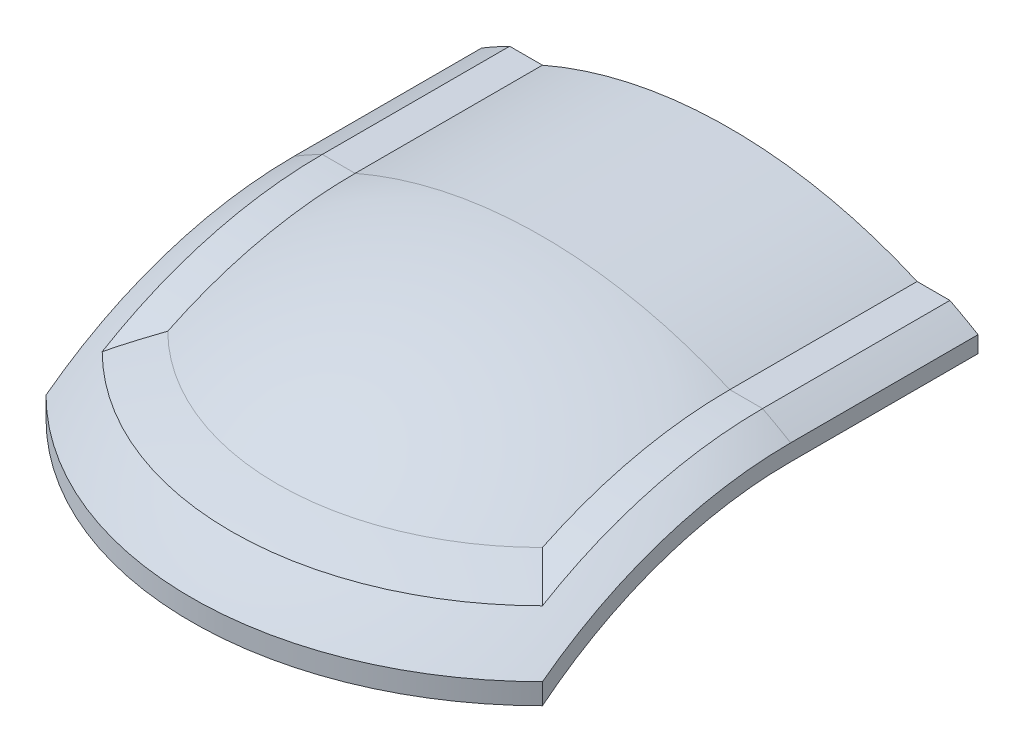
ISO-10303-21;
HEADER;
FILE_DESCRIPTION(('STEP AP214'),'2;1');
FILE_NAME('part.step','',(''),(''),'','','');
FILE_SCHEMA(('AUTOMOTIVE_DESIGN { 1 0 10303 214 1 1 1 1 }'));
ENDSEC;
DATA;
#1=APPLICATION_CONTEXT('core data for automotive mechanical design processes');
#2=APPLICATION_PROTOCOL_DEFINITION('international standard','automotive_design',2000,#1);
#3=PRODUCT_CONTEXT('',#1,'mechanical');
#4=PRODUCT('Part','Part','',(#3));
#5=PRODUCT_RELATED_PRODUCT_CATEGORY('part','',(#4));
#6=PRODUCT_DEFINITION_FORMATION('','',#4);
#7=PRODUCT_DEFINITION_CONTEXT('part definition',#1,'design');
#8=PRODUCT_DEFINITION('design','',#6,#7);
#9=PRODUCT_DEFINITION_SHAPE('','',#8);
#10=(LENGTH_UNIT() NAMED_UNIT(*) SI_UNIT(.MILLI.,.METRE.));
#11=(NAMED_UNIT(*) PLANE_ANGLE_UNIT() SI_UNIT($,.RADIAN.));
#12=(NAMED_UNIT(*) SI_UNIT($,.STERADIAN.) SOLID_ANGLE_UNIT());
#13=UNCERTAINTY_MEASURE_WITH_UNIT(LENGTH_MEASURE(1.E-05),#10,'distance_accuracy_value','');
#14=(GEOMETRIC_REPRESENTATION_CONTEXT(3) GLOBAL_UNCERTAINTY_ASSIGNED_CONTEXT((#13)) GLOBAL_UNIT_ASSIGNED_CONTEXT((#10,
#11,#12)) REPRESENTATION_CONTEXT('',''));
#15=CARTESIAN_POINT('',(0.,0.,0.));
#16=DIRECTION('',(0.,0.,1.));
#17=DIRECTION('',(1.,0.,0.));
#18=AXIS2_PLACEMENT_3D('',#15,#16,#17);
#19=CARTESIAN_POINT('',(-50.,0.,-40.));
#20=DIRECTION('',(1.,0.,0.));
#21=DIRECTION('',(0.,0.,-1.));
#22=AXIS2_PLACEMENT_3D('',#19,#20,#21);
#23=PLANE('',#22);
#24=DIRECTION('',(0.,-1.,0.));
#25=VECTOR('',#24,1.);
#26=CARTESIAN_POINT('',(-50.,0.,50.));
#27=LINE('',#26,#25);
#28=CARTESIAN_POINT('',(-50.,70.7106781186548,50.));
#29=VERTEX_POINT('',#28);
#30=CARTESIAN_POINT('',(-50.,66.4003012041362,50.));
#31=VERTEX_POINT('',#30);
#32=EDGE_CURVE('E318',#29,#31,#27,.T.);
#33=ORIENTED_EDGE('',*,*,#32,.F.);
#34=CARTESIAN_POINT('',(-50.,0.,0.));
#35=DIRECTION('',(-1.,0.,0.));
#36=DIRECTION('',(0.,-1.,0.));
#37=AXIS2_PLACEMENT_3D('',#34,#35,#36);
#38=CIRCLE('',#37,86.6025403784439);
#39=CARTESIAN_POINT('',(-50.,86.6025403784439,0.));
#40=VERTEX_POINT('',#39);
#41=EDGE_CURVE('E228',#29,#40,#38,.T.);
#42=ORIENTED_EDGE('',*,*,#41,.T.);
#43=DIRECTION('',(0.,0.,1.));
#44=VECTOR('',#43,1.);
#45=CARTESIAN_POINT('',(-50.,86.6025403784439,-40.));
#46=LINE('',#45,#44);
#47=CARTESIAN_POINT('',(-50.,86.6025403784439,-40.));
#48=VERTEX_POINT('',#47);
#49=EDGE_CURVE('E11',#48,#40,#46,.T.);
#50=ORIENTED_EDGE('',*,*,#49,.F.);
#51=DIRECTION('',(0.,1.,0.));
#52=VECTOR('',#51,1.);
#53=CARTESIAN_POINT('',(-50.,0.,-40.));
#54=LINE('',#53,#52);
#55=CARTESIAN_POINT('',(-50.,83.1203946092654,-40.));
#56=VERTEX_POINT('',#55);
#57=EDGE_CURVE('E53',#56,#48,#54,.T.);
#58=ORIENTED_EDGE('',*,*,#57,.F.);
#59=DIRECTION('',(0.,0.,1.));
#60=VECTOR('',#59,1.);
#61=CARTESIAN_POINT('',(-50.,83.1203946092654,-40.));
#62=LINE('',#61,#60);
#63=CARTESIAN_POINT('',(-50.,83.1203946092654,0.));
#64=VERTEX_POINT('',#63);
#65=EDGE_CURVE('E38',#56,#64,#62,.T.);
#66=ORIENTED_EDGE('',*,*,#65,.T.);
#67=CARTESIAN_POINT('',(-50.,0.,0.));
#68=DIRECTION('',(-1.,0.,0.));
#69=DIRECTION('',(0.,-1.,0.));
#70=AXIS2_PLACEMENT_3D('',#67,#68,#69);
#71=CIRCLE('',#70,83.1203946092654);
#72=EDGE_CURVE('E208',#31,#64,#71,.T.);
#73=ORIENTED_EDGE('',*,*,#72,.F.);
#74=EDGE_LOOP('',(#33,#42,#50,#58,#66,#73));
#75=FACE_BOUND('',#74,.T.);
#76=ADVANCED_FACE('F35',(#75),#23,.F.);
#77=CARTESIAN_POINT('',(-53.,0.,-40.));
#78=DIRECTION('',(1.,0.,0.));
#79=DIRECTION('',(0.,0.,-1.));
#80=AXIS2_PLACEMENT_3D('',#77,#78,#79);
#81=PLANE('',#80);
#82=DIRECTION('',(0.,-1.,0.));
#83=VECTOR('',#82,1.);
#84=CARTESIAN_POINT('',(-53.,0.,53.));
#85=LINE('',#84,#83);
#86=CARTESIAN_POINT('',(-53.,70.6470098447202,53.));
#87=VERTEX_POINT('',#86);
#88=CARTESIAN_POINT('',(-53.,66.1966766537415,53.));
#89=VERTEX_POINT('',#88);
#90=EDGE_CURVE('E231',#87,#89,#85,.T.);
#91=ORIENTED_EDGE('',*,*,#90,.F.);
#92=CARTESIAN_POINT('',(-53.,0.,0.));
#93=DIRECTION('',(-1.,0.,0.));
#94=DIRECTION('',(0.,-1.,0.));
#95=AXIS2_PLACEMENT_3D('',#92,#93,#94);
#96=CIRCLE('',#95,88.3176086632784);
#97=CARTESIAN_POINT('',(-53.,88.3176086632784,0.));
#98=VERTEX_POINT('',#97);
#99=EDGE_CURVE('E93',#87,#98,#96,.T.);
#100=ORIENTED_EDGE('',*,*,#99,.T.);
#101=DIRECTION('',(0.,0.,1.));
#102=VECTOR('',#101,1.);
#103=CARTESIAN_POINT('',(-53.,88.3176086632784,-40.));
#104=LINE('',#103,#102);
#105=CARTESIAN_POINT('',(-53.,88.3176086632784,-40.));
#106=VERTEX_POINT('',#105);
#107=EDGE_CURVE('E145',#106,#98,#104,.T.);
#108=ORIENTED_EDGE('',*,*,#107,.F.);
#109=DIRECTION('',(0.,1.,0.));
#110=VECTOR('',#109,1.);
#111=CARTESIAN_POINT('',(-53.,0.,-40.));
#112=LINE('',#111,#110);
#113=CARTESIAN_POINT('',(-53.,84.7997641506154,-40.));
#114=VERTEX_POINT('',#113);
#115=EDGE_CURVE('E137',#114,#106,#112,.T.);
#116=ORIENTED_EDGE('',*,*,#115,.F.);
#117=DIRECTION('',(0.,0.,1.));
#118=VECTOR('',#117,1.);
#119=CARTESIAN_POINT('',(-53.,84.7997641506154,-40.));
#120=LINE('',#119,#118);
#121=CARTESIAN_POINT('',(-53.,84.7997641506154,0.));
#122=VERTEX_POINT('',#121);
#123=EDGE_CURVE('E44',#114,#122,#120,.T.);
#124=ORIENTED_EDGE('',*,*,#123,.T.);
#125=CARTESIAN_POINT('',(-53.,0.,0.));
#126=DIRECTION('',(-1.,0.,0.));
#127=DIRECTION('',(0.,-1.,0.));
#128=AXIS2_PLACEMENT_3D('',#125,#126,#127);
#129=CIRCLE('',#128,84.7997641506154);
#130=EDGE_CURVE('E101',#89,#122,#129,.T.);
#131=ORIENTED_EDGE('',*,*,#130,.F.);
#132=EDGE_LOOP('',(#91,#100,#108,#116,#124,#131));
#133=FACE_BOUND('',#132,.T.);
#134=ADVANCED_FACE('F146',(#133),#81,.F.);
#135=CARTESIAN_POINT('',(-50.,0.,0.));
#136=DIRECTION('',(-1.,0.,0.));
#137=DIRECTION('',(0.,-1.,0.));
#138=AXIS2_PLACEMENT_3D('',#135,#136,#137);
#139=CYLINDRICAL_SURFACE('',#138,91.6515138991168);
#140=CARTESIAN_POINT('',(0.,0.,0.));
#141=DIRECTION('',(0.707106781186548,0.,0.707106781186548));
#142=DIRECTION('',(-0.707106781186548,0.,0.707106781186548));
#143=AXIS2_PLACEMENT_3D('',#140,#141,#142);
#144=ELLIPSE('',#143,129.614813968157,91.6515138991168);
#145=CARTESIAN_POINT('',(-40.,82.4621125123532,40.));
#146=VERTEX_POINT('',#145);
#147=CARTESIAN_POINT('',(-47.,78.6829079279611,47.));
#148=VERTEX_POINT('',#147);
#149=EDGE_CURVE('E226',#146,#148,#144,.T.);
#150=ORIENTED_EDGE('',*,*,#149,.F.);
#151=CARTESIAN_POINT('',(-40.,0.,0.));
#152=DIRECTION('',(-1.,0.,0.));
#153=DIRECTION('',(0.,-1.,0.));
#154=AXIS2_PLACEMENT_3D('',#151,#152,#153);
#155=CIRCLE('',#154,91.6515138991168);
#156=CARTESIAN_POINT('',(-40.,91.6515138991168,0.));
#157=VERTEX_POINT('',#156);
#158=EDGE_CURVE('E241',#146,#157,#155,.T.);
#159=ORIENTED_EDGE('',*,*,#158,.T.);
#160=DIRECTION('',(1.,0.,0.));
#161=VECTOR('',#160,1.);
#162=CARTESIAN_POINT('',(0.,91.6515138991168,0.));
#163=LINE('',#162,#161);
#164=CARTESIAN_POINT('',(-47.,91.6515138991168,0.));
#165=VERTEX_POINT('',#164);
#166=EDGE_CURVE('E176',#165,#157,#163,.T.);
#167=ORIENTED_EDGE('',*,*,#166,.F.);
#168=CARTESIAN_POINT('',(-47.,0.,0.));
#169=DIRECTION('',(-1.,0.,0.));
#170=DIRECTION('',(0.,-1.,0.));
#171=AXIS2_PLACEMENT_3D('',#168,#169,#170);
#172=CIRCLE('',#171,91.6515138991168);
#173=EDGE_CURVE('E239',#148,#165,#172,.T.);
#174=ORIENTED_EDGE('',*,*,#173,.F.);
#175=EDGE_LOOP('',(#150,#159,#167,#174));
#176=FACE_BOUND('',#175,.T.);
#177=ADVANCED_FACE('F342',(#176),#139,.T.);
#178=CARTESIAN_POINT('',(0.,0.,-40.));
#179=DIRECTION('',(0.,0.,1.));
#180=DIRECTION('',(1.,0.,0.));
#181=AXIS2_PLACEMENT_3D('',#178,#179,#180);
#182=CYLINDRICAL_SURFACE('',#181,100.);
#183=CARTESIAN_POINT('',(0.,0.,0.));
#184=DIRECTION('',(0.,0.,1.));
#185=DIRECTION('',(1.,0.,0.));
#186=AXIS2_PLACEMENT_3D('',#183,#184,#185);
#187=CIRCLE('',#186,100.);
#188=EDGE_CURVE('E181',#122,#40,#187,.F.);
#189=ORIENTED_EDGE('',*,*,#188,.F.);
#190=ORIENTED_EDGE('',*,*,#123,.F.);
#191=CARTESIAN_POINT('',(0.,0.,-40.));
#192=DIRECTION('',(0.,0.,1.));
#193=DIRECTION('',(1.,0.,0.));
#194=AXIS2_PLACEMENT_3D('',#191,#192,#193);
#195=CIRCLE('',#194,100.);
#196=EDGE_CURVE('E143',#114,#48,#195,.F.);
#197=ORIENTED_EDGE('',*,*,#196,.T.);
#198=ORIENTED_EDGE('',*,*,#49,.T.);
#199=EDGE_LOOP('',(#189,#190,#197,#198));
#200=FACE_BOUND('',#199,.T.);
#201=ADVANCED_FACE('F378',(#200),#182,.F.);
#202=CARTESIAN_POINT('',(0.,0.,-40.));
#203=DIRECTION('',(0.,0.,1.));
#204=DIRECTION('',(1.,0.,0.));
#205=AXIS2_PLACEMENT_3D('',#202,#203,#204);
#206=CYLINDRICAL_SURFACE('',#205,103.);
#207=CARTESIAN_POINT('',(0.,0.,0.));
#208=DIRECTION('',(0.,0.,1.));
#209=DIRECTION('',(1.,0.,0.));
#210=AXIS2_PLACEMENT_3D('',#207,#208,#209);
#211=CIRCLE('',#210,103.);
#212=EDGE_CURVE('E179',#98,#165,#211,.F.);
#213=ORIENTED_EDGE('',*,*,#212,.T.);
#214=DIRECTION('',(0.,0.,1.));
#215=VECTOR('',#214,1.);
#216=CARTESIAN_POINT('',(-47.,91.6515138991168,-40.));
#217=LINE('',#216,#215);
#218=CARTESIAN_POINT('',(-47.,91.6515138991168,-40.));
#219=VERTEX_POINT('',#218);
#220=EDGE_CURVE('E150',#219,#165,#217,.T.);
#221=ORIENTED_EDGE('',*,*,#220,.F.);
#222=CARTESIAN_POINT('',(0.,0.,-40.));
#223=DIRECTION('',(0.,0.,1.));
#224=DIRECTION('',(1.,0.,0.));
#225=AXIS2_PLACEMENT_3D('',#222,#223,#224);
#226=CIRCLE('',#225,103.);
#227=EDGE_CURVE('E140',#106,#219,#226,.F.);
#228=ORIENTED_EDGE('',*,*,#227,.F.);
#229=ORIENTED_EDGE('',*,*,#107,.T.);
#230=EDGE_LOOP('',(#213,#221,#228,#229));
#231=FACE_BOUND('',#230,.T.);
#232=ADVANCED_FACE('F152',(#231),#206,.T.);
#233=CARTESIAN_POINT('',(0.,91.6515138991168,-40.));
#234=DIRECTION('',(0.,-1.,0.));
#235=DIRECTION('',(0.,0.,-1.));
#236=AXIS2_PLACEMENT_3D('',#233,#234,#235);
#237=PLANE('',#236);
#238=ORIENTED_EDGE('',*,*,#166,.T.);
#239=DIRECTION('',(0.,0.,1.));
#240=VECTOR('',#239,1.);
#241=CARTESIAN_POINT('',(-40.,91.6515138991168,-40.));
#242=LINE('',#241,#240);
#243=CARTESIAN_POINT('',(-40.,91.6515138991168,-40.));
#244=VERTEX_POINT('',#243);
#245=EDGE_CURVE('E185',#244,#157,#242,.T.);
#246=ORIENTED_EDGE('',*,*,#245,.F.);
#247=DIRECTION('',(1.,0.,0.));
#248=VECTOR('',#247,1.);
#249=CARTESIAN_POINT('',(0.,91.6515138991168,-40.));
#250=LINE('',#249,#248);
#251=EDGE_CURVE('E155',#219,#244,#250,.T.);
#252=ORIENTED_EDGE('',*,*,#251,.F.);
#253=ORIENTED_EDGE('',*,*,#220,.T.);
#254=EDGE_LOOP('',(#238,#246,#252,#253));
#255=FACE_BOUND('',#254,.T.);
#256=ADVANCED_FACE('F339',(#255),#237,.F.);
#257=CARTESIAN_POINT('',(0.,0.,-40.));
#258=DIRECTION('',(0.,0.,1.));
#259=DIRECTION('',(1.,0.,0.));
#260=AXIS2_PLACEMENT_3D('',#257,#258,#259);
#261=CYLINDRICAL_SURFACE('',#260,100.);
#262=CARTESIAN_POINT('',(0.,0.,0.));
#263=DIRECTION('',(0.,0.,1.));
#264=DIRECTION('',(1.,0.,0.));
#265=AXIS2_PLACEMENT_3D('',#262,#263,#264);
#266=CIRCLE('',#265,100.);
#267=CARTESIAN_POINT('',(40.,91.6515138991168,0.));
#268=VERTEX_POINT('',#267);
#269=EDGE_CURVE('E174',#157,#268,#266,.F.);
#270=ORIENTED_EDGE('',*,*,#269,.T.);
#271=DIRECTION('',(0.,0.,1.));
#272=VECTOR('',#271,1.);
#273=CARTESIAN_POINT('',(40.,91.6515138991168,-40.));
#274=LINE('',#273,#272);
#275=CARTESIAN_POINT('',(40.,91.6515138991168,-40.));
#276=VERTEX_POINT('',#275);
#277=EDGE_CURVE('E188',#276,#268,#274,.T.);
#278=ORIENTED_EDGE('',*,*,#277,.F.);
#279=CARTESIAN_POINT('',(0.,0.,-40.));
#280=DIRECTION('',(0.,0.,1.));
#281=DIRECTION('',(1.,0.,0.));
#282=AXIS2_PLACEMENT_3D('',#279,#280,#281);
#283=CIRCLE('',#282,100.);
#284=EDGE_CURVE('E157',#244,#276,#283,.F.);
#285=ORIENTED_EDGE('',*,*,#284,.F.);
#286=ORIENTED_EDGE('',*,*,#245,.T.);
#287=EDGE_LOOP('',(#270,#278,#285,#286));
#288=FACE_BOUND('',#287,.T.);
#289=ADVANCED_FACE('F273',(#288),#261,.T.);
#290=CARTESIAN_POINT('',(-1.81702894593844E-13,91.6515138991167,-40.));
#291=DIRECTION('',(0.,1.,0.));
#292=DIRECTION('',(-1.,0.,0.));
#293=AXIS2_PLACEMENT_3D('',#290,#291,#292);
#294=PLANE('',#293);
#295=DIRECTION('',(-1.,0.,0.));
#296=VECTOR('',#295,1.);
#297=CARTESIAN_POINT('',(-1.81702894593844E-13,91.6515138991167,0.));
#298=LINE('',#297,#296);
#299=CARTESIAN_POINT('',(47.,91.6515138991168,0.));
#300=VERTEX_POINT('',#299);
#301=EDGE_CURVE('E171',#300,#268,#298,.T.);
#302=ORIENTED_EDGE('',*,*,#301,.F.);
#303=DIRECTION('',(0.,0.,1.));
#304=VECTOR('',#303,1.);
#305=CARTESIAN_POINT('',(47.,91.6515138991168,-40.));
#306=LINE('',#305,#304);
#307=CARTESIAN_POINT('',(47.,91.6515138991168,-40.));
#308=VERTEX_POINT('',#307);
#309=EDGE_CURVE('E191',#308,#300,#306,.T.);
#310=ORIENTED_EDGE('',*,*,#309,.F.);
#311=DIRECTION('',(-1.,0.,0.));
#312=VECTOR('',#311,1.);
#313=CARTESIAN_POINT('',(-1.81702894593844E-13,91.6515138991167,-40.));
#314=LINE('',#313,#312);
#315=EDGE_CURVE('E266',#308,#276,#314,.T.);
#316=ORIENTED_EDGE('',*,*,#315,.T.);
#317=ORIENTED_EDGE('',*,*,#277,.T.);
#318=EDGE_LOOP('',(#302,#310,#316,#317));
#319=FACE_BOUND('',#318,.T.);
#320=ADVANCED_FACE('F277',(#319),#294,.T.);
#321=CARTESIAN_POINT('',(0.,0.,-40.));
#322=DIRECTION('',(0.,0.,1.));
#323=DIRECTION('',(1.,0.,0.));
#324=AXIS2_PLACEMENT_3D('',#321,#322,#323);
#325=CYLINDRICAL_SURFACE('',#324,103.);
#326=CARTESIAN_POINT('',(0.,0.,0.));
#327=DIRECTION('',(0.,0.,1.));
#328=DIRECTION('',(1.,0.,0.));
#329=AXIS2_PLACEMENT_3D('',#326,#327,#328);
#330=CIRCLE('',#329,103.);
#331=CARTESIAN_POINT('',(53.,88.3176086632784,0.));
#332=VERTEX_POINT('',#331);
#333=EDGE_CURVE('E168',#300,#332,#330,.F.);
#334=ORIENTED_EDGE('',*,*,#333,.T.);
#335=DIRECTION('',(0.,0.,1.));
#336=VECTOR('',#335,1.);
#337=CARTESIAN_POINT('',(53.,88.3176086632784,-40.));
#338=LINE('',#337,#336);
#339=CARTESIAN_POINT('',(53.,88.3176086632784,-40.));
#340=VERTEX_POINT('',#339);
#341=EDGE_CURVE('E194',#340,#332,#338,.T.);
#342=ORIENTED_EDGE('',*,*,#341,.F.);
#343=CARTESIAN_POINT('',(0.,0.,-40.));
#344=DIRECTION('',(0.,0.,1.));
#345=DIRECTION('',(1.,0.,0.));
#346=AXIS2_PLACEMENT_3D('',#343,#344,#345);
#347=CIRCLE('',#346,103.);
#348=EDGE_CURVE('E264',#308,#340,#347,.F.);
#349=ORIENTED_EDGE('',*,*,#348,.F.);
#350=ORIENTED_EDGE('',*,*,#309,.T.);
#351=EDGE_LOOP('',(#334,#342,#349,#350));
#352=FACE_BOUND('',#351,.T.);
#353=ADVANCED_FACE('F282',(#352),#325,.T.);
#354=CARTESIAN_POINT('',(53.,0.,-40.));
#355=DIRECTION('',(1.,0.,0.));
#356=DIRECTION('',(0.,0.,-1.));
#357=AXIS2_PLACEMENT_3D('',#354,#355,#356);
#358=PLANE('',#357);
#359=DIRECTION('',(0.,1.,0.));
#360=VECTOR('',#359,1.);
#361=CARTESIAN_POINT('',(53.,0.,53.));
#362=LINE('',#361,#360);
#363=CARTESIAN_POINT('',(53.,66.1966766537414,53.));
#364=VERTEX_POINT('',#363);
#365=CARTESIAN_POINT('',(53.,70.6470098447202,53.));
#366=VERTEX_POINT('',#365);
#367=EDGE_CURVE('E305',#364,#366,#362,.T.);
#368=ORIENTED_EDGE('',*,*,#367,.F.);
#369=CARTESIAN_POINT('',(53.,0.,0.));
#370=DIRECTION('',(-1.,0.,0.));
#371=DIRECTION('',(0.,-1.,0.));
#372=AXIS2_PLACEMENT_3D('',#369,#370,#371);
#373=CIRCLE('',#372,84.7997641506154);
#374=CARTESIAN_POINT('',(53.,84.7997641506154,0.));
#375=VERTEX_POINT('',#374);
#376=EDGE_CURVE('E250',#364,#375,#373,.T.);
#377=ORIENTED_EDGE('',*,*,#376,.T.);
#378=DIRECTION('',(0.,0.,1.));
#379=VECTOR('',#378,1.);
#380=CARTESIAN_POINT('',(53.,84.7997641506154,-40.));
#381=LINE('',#380,#379);
#382=CARTESIAN_POINT('',(53.,84.7997641506154,-40.));
#383=VERTEX_POINT('',#382);
#384=EDGE_CURVE('E197',#383,#375,#381,.T.);
#385=ORIENTED_EDGE('',*,*,#384,.F.);
#386=DIRECTION('',(0.,1.,0.));
#387=VECTOR('',#386,1.);
#388=CARTESIAN_POINT('',(53.,0.,-40.));
#389=LINE('',#388,#387);
#390=EDGE_CURVE('E261',#383,#340,#389,.T.);
#391=ORIENTED_EDGE('',*,*,#390,.T.);
#392=ORIENTED_EDGE('',*,*,#341,.T.);
#393=CARTESIAN_POINT('',(53.,0.,0.));
#394=DIRECTION('',(-1.,0.,0.));
#395=DIRECTION('',(0.,-1.,0.));
#396=AXIS2_PLACEMENT_3D('',#393,#394,#395);
#397=CIRCLE('',#396,88.3176086632784);
#398=EDGE_CURVE('E248',#366,#332,#397,.T.);
#399=ORIENTED_EDGE('',*,*,#398,.F.);
#400=EDGE_LOOP('',(#368,#377,#385,#391,#392,#399));
#401=FACE_BOUND('',#400,.T.);
#402=ADVANCED_FACE('F361',(#401),#358,.T.);
#403=CARTESIAN_POINT('',(0.,0.,-40.));
#404=DIRECTION('',(0.,0.,1.));
#405=DIRECTION('',(1.,0.,0.));
#406=AXIS2_PLACEMENT_3D('',#403,#404,#405);
#407=CYLINDRICAL_SURFACE('',#406,100.);
#408=CARTESIAN_POINT('',(0.,0.,0.));
#409=DIRECTION('',(0.,0.,1.));
#410=DIRECTION('',(1.,0.,0.));
#411=AXIS2_PLACEMENT_3D('',#408,#409,#410);
#412=CIRCLE('',#411,100.);
#413=CARTESIAN_POINT('',(50.,86.6025403784439,0.));
#414=VERTEX_POINT('',#413);
#415=EDGE_CURVE('E164',#414,#375,#412,.F.);
#416=ORIENTED_EDGE('',*,*,#415,.F.);
#417=DIRECTION('',(0.,0.,1.));
#418=VECTOR('',#417,1.);
#419=CARTESIAN_POINT('',(50.,86.6025403784439,-40.));
#420=LINE('',#419,#418);
#421=CARTESIAN_POINT('',(50.,86.6025403784439,-40.));
#422=VERTEX_POINT('',#421);
#423=EDGE_CURVE('E200',#422,#414,#420,.T.);
#424=ORIENTED_EDGE('',*,*,#423,.F.);
#425=CARTESIAN_POINT('',(0.,0.,-40.));
#426=DIRECTION('',(0.,0.,1.));
#427=DIRECTION('',(1.,0.,0.));
#428=AXIS2_PLACEMENT_3D('',#425,#426,#427);
#429=CIRCLE('',#428,100.);
#430=EDGE_CURVE('E258',#422,#383,#429,.F.);
#431=ORIENTED_EDGE('',*,*,#430,.T.);
#432=ORIENTED_EDGE('',*,*,#384,.T.);
#433=EDGE_LOOP('',(#416,#424,#431,#432));
#434=FACE_BOUND('',#433,.T.);
#435=ADVANCED_FACE('F288',(#434),#407,.F.);
#436=CARTESIAN_POINT('',(50.,0.,-40.));
#437=DIRECTION('',(1.,0.,0.));
#438=DIRECTION('',(0.,0.,-1.));
#439=AXIS2_PLACEMENT_3D('',#436,#437,#438);
#440=PLANE('',#439);
#441=DIRECTION('',(0.,1.,0.));
#442=VECTOR('',#441,1.);
#443=CARTESIAN_POINT('',(50.,0.,50.));
#444=LINE('',#443,#442);
#445=CARTESIAN_POINT('',(50.0000000000002,66.4003012041361,49.9999999999998));
#446=VERTEX_POINT('',#445);
#447=CARTESIAN_POINT('',(50.,70.7106781186547,50.));
#448=VERTEX_POINT('',#447);
#449=EDGE_CURVE('E224',#446,#448,#444,.T.);
#450=ORIENTED_EDGE('',*,*,#449,.F.);
#451=CARTESIAN_POINT('',(50.,0.,0.));
#452=DIRECTION('',(-1.,0.,0.));
#453=DIRECTION('',(0.,-1.,0.));
#454=AXIS2_PLACEMENT_3D('',#451,#452,#453);
#455=CIRCLE('',#454,83.1203946092654);
#456=CARTESIAN_POINT('',(50.,83.1203946092654,0.));
#457=VERTEX_POINT('',#456);
#458=EDGE_CURVE('E216',#446,#457,#455,.T.);
#459=ORIENTED_EDGE('',*,*,#458,.T.);
#460=DIRECTION('',(0.,0.,1.));
#461=VECTOR('',#460,1.);
#462=CARTESIAN_POINT('',(50.,83.1203946092654,-40.));
#463=LINE('',#462,#461);
#464=CARTESIAN_POINT('',(50.,83.1203946092654,-40.));
#465=VERTEX_POINT('',#464);
#466=EDGE_CURVE('E202',#465,#457,#463,.T.);
#467=ORIENTED_EDGE('',*,*,#466,.F.);
#468=DIRECTION('',(0.,1.,0.));
#469=VECTOR('',#468,1.);
#470=CARTESIAN_POINT('',(50.,0.,-40.));
#471=LINE('',#470,#469);
#472=EDGE_CURVE('E256',#465,#422,#471,.T.);
#473=ORIENTED_EDGE('',*,*,#472,.T.);
#474=ORIENTED_EDGE('',*,*,#423,.T.);
#475=CARTESIAN_POINT('',(50.,0.,0.));
#476=DIRECTION('',(-1.,0.,0.));
#477=DIRECTION('',(0.,-1.,0.));
#478=AXIS2_PLACEMENT_3D('',#475,#476,#477);
#479=CIRCLE('',#478,86.6025403784438);
#480=EDGE_CURVE('E165',#448,#414,#479,.T.);
#481=ORIENTED_EDGE('',*,*,#480,.F.);
#482=EDGE_LOOP('',(#450,#459,#467,#473,#474,#481));
#483=FACE_BOUND('',#482,.T.);
#484=ADVANCED_FACE('F219',(#483),#440,.T.);
#485=CARTESIAN_POINT('',(0.,0.,-40.));
#486=DIRECTION('',(0.,0.,1.));
#487=DIRECTION('',(1.,0.,0.));
#488=AXIS2_PLACEMENT_3D('',#485,#486,#487);
#489=CYLINDRICAL_SURFACE('',#488,97.);
#490=CARTESIAN_POINT('',(0.,0.,0.));
#491=DIRECTION('',(0.,0.,1.));
#492=DIRECTION('',(1.,0.,0.));
#493=AXIS2_PLACEMENT_3D('',#490,#491,#492);
#494=CIRCLE('',#493,97.);
#495=EDGE_CURVE('E162',#64,#457,#494,.F.);
#496=ORIENTED_EDGE('',*,*,#495,.F.);
#497=ORIENTED_EDGE('',*,*,#65,.F.);
#498=CARTESIAN_POINT('',(0.,0.,-40.));
#499=DIRECTION('',(0.,0.,1.));
#500=DIRECTION('',(1.,0.,0.));
#501=AXIS2_PLACEMENT_3D('',#498,#499,#500);
#502=CIRCLE('',#501,97.);
#503=EDGE_CURVE('E254',#56,#465,#502,.F.);
#504=ORIENTED_EDGE('',*,*,#503,.T.);
#505=ORIENTED_EDGE('',*,*,#466,.T.);
#506=EDGE_LOOP('',(#496,#497,#504,#505));
#507=FACE_BOUND('',#506,.T.);
#508=ADVANCED_FACE('F210',(#507),#489,.F.);
#509=CARTESIAN_POINT('',(0.,0.,-40.));
#510=DIRECTION('',(0.,0.,1.));
#511=DIRECTION('',(1.,0.,0.));
#512=AXIS2_PLACEMENT_3D('',#509,#510,#511);
#513=PLANE('',#512);
#514=ORIENTED_EDGE('',*,*,#57,.T.);
#515=ORIENTED_EDGE('',*,*,#196,.F.);
#516=ORIENTED_EDGE('',*,*,#115,.T.);
#517=ORIENTED_EDGE('',*,*,#227,.T.);
#518=ORIENTED_EDGE('',*,*,#251,.T.);
#519=ORIENTED_EDGE('',*,*,#284,.T.);
#520=ORIENTED_EDGE('',*,*,#315,.F.);
#521=ORIENTED_EDGE('',*,*,#348,.T.);
#522=ORIENTED_EDGE('',*,*,#390,.F.);
#523=ORIENTED_EDGE('',*,*,#430,.F.);
#524=ORIENTED_EDGE('',*,*,#472,.F.);
#525=ORIENTED_EDGE('',*,*,#503,.F.);
#526=EDGE_LOOP('',(#514,#515,#516,#517,#518,#519,#520,#521,#522,#523,#524,#525));
#527=FACE_BOUND('',#526,.T.);
#528=ADVANCED_FACE('F138',(#527),#513,.F.);
#529=CARTESIAN_POINT('',(0.,0.,0.));
#530=DIRECTION('',(-1.,0.,0.));
#531=DIRECTION('',(0.,0.,1.));
#532=AXIS2_PLACEMENT_3D('',#529,#530,#531);
#533=SPHERICAL_SURFACE('',#532,100.);
#534=ORIENTED_EDGE('',*,*,#376,.F.);
#535=CARTESIAN_POINT('',(0.,66.1966766537415,0.));
#536=DIRECTION('',(0.,-1.,0.));
#537=DIRECTION('',(0.,0.,-1.));
#538=AXIS2_PLACEMENT_3D('',#535,#536,#537);
#539=CIRCLE('',#538,74.953318805774);
#540=EDGE_CURVE('E301',#364,#89,#539,.T.);
#541=ORIENTED_EDGE('',*,*,#540,.T.);
#542=ORIENTED_EDGE('',*,*,#130,.T.);
#543=ORIENTED_EDGE('',*,*,#188,.T.);
#544=ORIENTED_EDGE('',*,*,#41,.F.);
#545=CARTESIAN_POINT('',(0.,70.7106781186548,0.));
#546=DIRECTION('',(0.,-1.,0.));
#547=DIRECTION('',(0.,0.,-1.));
#548=AXIS2_PLACEMENT_3D('',#545,#546,#547);
#549=CIRCLE('',#548,70.7106781186548);
#550=EDGE_CURVE('E295',#448,#29,#549,.T.);
#551=ORIENTED_EDGE('',*,*,#550,.F.);
#552=ORIENTED_EDGE('',*,*,#480,.T.);
#553=ORIENTED_EDGE('',*,*,#415,.T.);
#554=EDGE_LOOP('',(#534,#541,#542,#543,#544,#551,#552,#553));
#555=FACE_BOUND('',#554,.T.);
#556=ADVANCED_FACE('F297',(#555),#533,.F.);
#557=CARTESIAN_POINT('',(0.,0.,0.));
#558=DIRECTION('',(-1.,0.,0.));
#559=DIRECTION('',(0.,0.,1.));
#560=AXIS2_PLACEMENT_3D('',#557,#558,#559);
#561=SPHERICAL_SURFACE('',#560,103.);
#562=CARTESIAN_POINT('',(47.,0.,0.));
#563=DIRECTION('',(-1.,0.,0.));
#564=DIRECTION('',(0.,-1.,0.));
#565=AXIS2_PLACEMENT_3D('',#562,#563,#564);
#566=CIRCLE('',#565,91.6515138991168);
#567=CARTESIAN_POINT('',(47.,78.6829079279611,47.));
#568=VERTEX_POINT('',#567);
#569=EDGE_CURVE('E246',#568,#300,#566,.T.);
#570=ORIENTED_EDGE('',*,*,#569,.F.);
#571=CARTESIAN_POINT('',(0.,78.6829079279611,0.));
#572=DIRECTION('',(0.,-1.,0.));
#573=DIRECTION('',(0.,0.,-1.));
#574=AXIS2_PLACEMENT_3D('',#571,#572,#573);
#575=CIRCLE('',#574,66.4680374315354);
#576=EDGE_CURVE('E312',#568,#148,#575,.T.);
#577=ORIENTED_EDGE('',*,*,#576,.T.);
#578=ORIENTED_EDGE('',*,*,#173,.T.);
#579=ORIENTED_EDGE('',*,*,#212,.F.);
#580=ORIENTED_EDGE('',*,*,#99,.F.);
#581=CARTESIAN_POINT('',(0.,70.6470098447202,0.));
#582=DIRECTION('',(0.,-1.,0.));
#583=DIRECTION('',(0.,0.,-1.));
#584=AXIS2_PLACEMENT_3D('',#581,#582,#583);
#585=CIRCLE('',#584,74.9533188057741);
#586=EDGE_CURVE('E327',#366,#87,#585,.T.);
#587=ORIENTED_EDGE('',*,*,#586,.F.);
#588=ORIENTED_EDGE('',*,*,#398,.T.);
#589=ORIENTED_EDGE('',*,*,#333,.F.);
#590=EDGE_LOOP('',(#570,#577,#578,#579,#580,#587,#588,#589));
#591=FACE_BOUND('',#590,.T.);
#592=ADVANCED_FACE('F333',(#591),#561,.T.);
#593=CARTESIAN_POINT('',(-50.,0.,0.));
#594=DIRECTION('',(-1.,0.,0.));
#595=DIRECTION('',(0.,-1.,0.));
#596=AXIS2_PLACEMENT_3D('',#593,#594,#595);
#597=CYLINDRICAL_SURFACE('',#596,91.6515138991168);
#598=CARTESIAN_POINT('',(40.,0.,0.));
#599=DIRECTION('',(-1.,0.,0.));
#600=DIRECTION('',(0.,-1.,0.));
#601=AXIS2_PLACEMENT_3D('',#598,#599,#600);
#602=CIRCLE('',#601,91.6515138991168);
#603=CARTESIAN_POINT('',(40.,82.4621125123532,40.));
#604=VERTEX_POINT('',#603);
#605=EDGE_CURVE('E243',#604,#268,#602,.T.);
#606=ORIENTED_EDGE('',*,*,#605,.F.);
#607=CARTESIAN_POINT('',(0.,0.,0.));
#608=DIRECTION('',(0.707106781186547,0.,-0.707106781186548));
#609=DIRECTION('',(-0.707106781186548,0.,-0.707106781186547));
#610=AXIS2_PLACEMENT_3D('',#607,#608,#609);
#611=ELLIPSE('',#610,129.614813968157,91.6515138991168);
#612=EDGE_CURVE('E309',#604,#568,#611,.T.);
#613=ORIENTED_EDGE('',*,*,#612,.T.);
#614=ORIENTED_EDGE('',*,*,#569,.T.);
#615=ORIENTED_EDGE('',*,*,#301,.T.);
#616=EDGE_LOOP('',(#606,#613,#614,#615));
#617=FACE_BOUND('',#616,.T.);
#618=ADVANCED_FACE('F357',(#617),#597,.T.);
#619=CARTESIAN_POINT('',(0.,0.,0.));
#620=DIRECTION('',(-1.,0.,0.));
#621=DIRECTION('',(0.,0.,1.));
#622=AXIS2_PLACEMENT_3D('',#619,#620,#621);
#623=SPHERICAL_SURFACE('',#622,100.);
#624=ORIENTED_EDGE('',*,*,#605,.T.);
#625=ORIENTED_EDGE('',*,*,#269,.F.);
#626=ORIENTED_EDGE('',*,*,#158,.F.);
#627=CARTESIAN_POINT('',(0.,82.4621125123533,0.));
#628=DIRECTION('',(0.,-1.,0.));
#629=DIRECTION('',(0.,0.,-1.));
#630=AXIS2_PLACEMENT_3D('',#627,#628,#629);
#631=CIRCLE('',#630,56.5685424949237);
#632=EDGE_CURVE('E306',#604,#146,#631,.T.);
#633=ORIENTED_EDGE('',*,*,#632,.F.);
#634=EDGE_LOOP('',(#624,#625,#626,#633));
#635=FACE_BOUND('',#634,.T.);
#636=ADVANCED_FACE('F347',(#635),#623,.T.);
#637=CARTESIAN_POINT('',(0.,0.,0.));
#638=DIRECTION('',(-1.,0.,0.));
#639=DIRECTION('',(0.,0.,1.));
#640=AXIS2_PLACEMENT_3D('',#637,#638,#639);
#641=SPHERICAL_SURFACE('',#640,97.);
#642=ORIENTED_EDGE('',*,*,#458,.F.);
#643=CARTESIAN_POINT('',(0.,66.4003012041361,0.));
#644=DIRECTION('',(0.,-1.,0.));
#645=DIRECTION('',(0.,0.,-1.));
#646=AXIS2_PLACEMENT_3D('',#643,#644,#645);
#647=CIRCLE('',#646,70.7106781186548);
#648=EDGE_CURVE('E302',#446,#31,#647,.T.);
#649=ORIENTED_EDGE('',*,*,#648,.T.);
#650=ORIENTED_EDGE('',*,*,#72,.T.);
#651=ORIENTED_EDGE('',*,*,#495,.T.);
#652=EDGE_LOOP('',(#642,#649,#650,#651));
#653=FACE_BOUND('',#652,.T.);
#654=ADVANCED_FACE('F214',(#653),#641,.F.);
#655=CARTESIAN_POINT('',(0.,0.,0.));
#656=DIRECTION('',(0.707106781186545,0.,-0.70710678118655));
#657=DIRECTION('',(0.70710678118655,0.,0.707106781186545));
#658=AXIS2_PLACEMENT_3D('',#655,#656,#657);
#659=ELLIPSE('',#658,129.614813968157,91.6515138991168);
#660=TRIMMED_CURVE('',#659,(PARAMETER_VALUE(4.71238898038469)),
(PARAMETER_VALUE(7.85398163397448)),.T.,.PARAMETER.);
#661=CARTESIAN_POINT('',(0.,0.,0.));
#662=DIRECTION('',(0.,-1.,0.));
#663=AXIS1_PLACEMENT('',#661,#662);
#664=SURFACE_OF_REVOLUTION('',#660,#663);
#665=ORIENTED_EDGE('',*,*,#576,.F.);
#666=ORIENTED_EDGE('',*,*,#612,.F.);
#667=ORIENTED_EDGE('',*,*,#632,.T.);
#668=ORIENTED_EDGE('',*,*,#149,.T.);
#669=EDGE_LOOP('',(#665,#666,#667,#668));
#670=FACE_BOUND('',#669,.T.);
#671=ADVANCED_FACE('F352',(#670),#664,.T.);
#672=CARTESIAN_POINT('',(0.,0.,0.));
#673=DIRECTION('',(0.,-1.,0.));
#674=DIRECTION('',(0.,0.,-1.));
#675=AXIS2_PLACEMENT_3D('',#672,#673,#674);
#676=CYLINDRICAL_SURFACE('',#675,74.953318805774);
#677=ORIENTED_EDGE('',*,*,#540,.F.);
#678=ORIENTED_EDGE('',*,*,#367,.T.);
#679=ORIENTED_EDGE('',*,*,#586,.T.);
#680=ORIENTED_EDGE('',*,*,#90,.T.);
#681=EDGE_LOOP('',(#677,#678,#679,#680));
#682=FACE_BOUND('',#681,.T.);
#683=ADVANCED_FACE('F324',(#682),#676,.T.);
#684=CARTESIAN_POINT('',(0.,0.,0.));
#685=DIRECTION('',(0.,-1.,0.));
#686=DIRECTION('',(0.,0.,-1.));
#687=AXIS2_PLACEMENT_3D('',#684,#685,#686);
#688=CYLINDRICAL_SURFACE('',#687,70.7106781186548);
#689=ORIENTED_EDGE('',*,*,#648,.F.);
#690=ORIENTED_EDGE('',*,*,#449,.T.);
#691=ORIENTED_EDGE('',*,*,#550,.T.);
#692=ORIENTED_EDGE('',*,*,#32,.T.);
#693=EDGE_LOOP('',(#689,#690,#691,#692));
#694=FACE_BOUND('',#693,.T.);
#695=ADVANCED_FACE('F304',(#694),#688,.T.);
#696=CLOSED_SHELL('',(#76,#134,#177,#201,#232,#256,#289,#320,#353,#402,#435,#484,#508,#528,#556,
#592,#618,#636,#654,#671,#683,#695));
#697=MANIFOLD_SOLID_BREP('B2',#696);
#698=ADVANCED_BREP_SHAPE_REPRESENTATION('',(#18,#697),#14);
#699=SHAPE_DEFINITION_REPRESENTATION(#9,#698);
ENDSEC;
END-ISO-10303-21;
